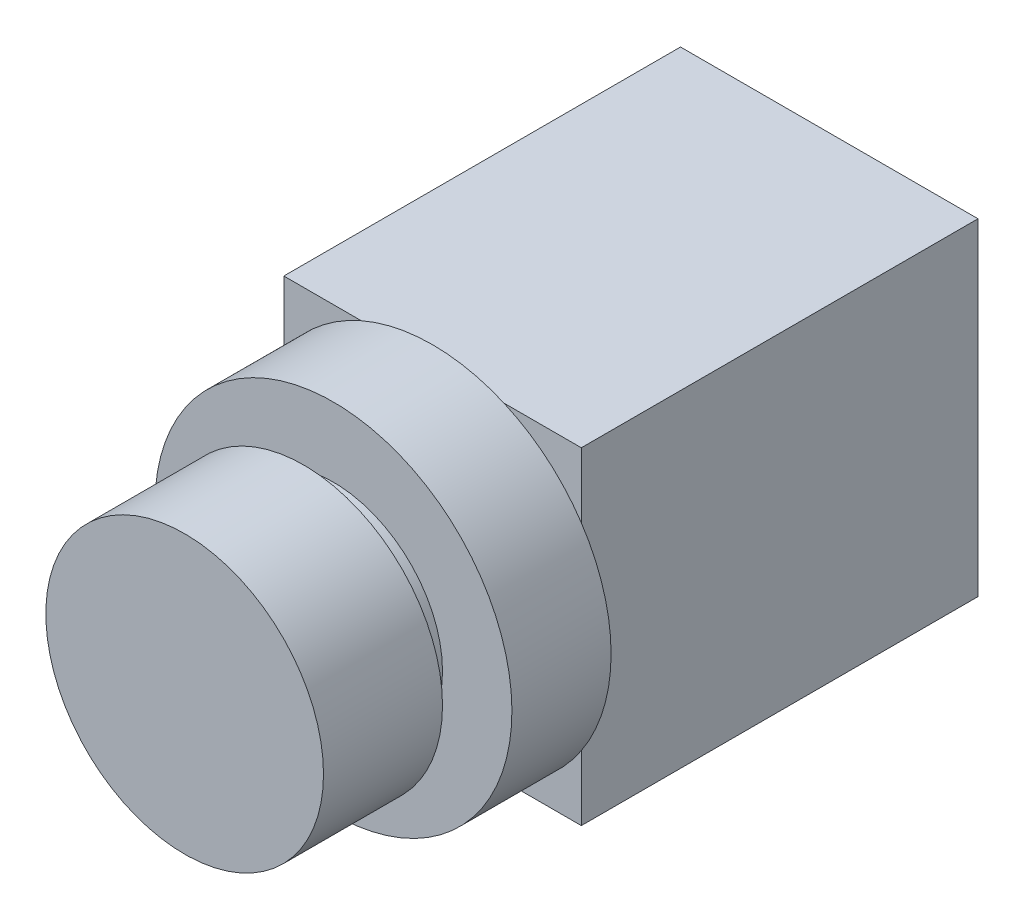
ISO-10303-21;
HEADER;
FILE_DESCRIPTION(('STEP AP214'),'2;1');
FILE_NAME('part.step','',(''),(''),'','','');
FILE_SCHEMA(('AUTOMOTIVE_DESIGN { 1 0 10303 214 1 1 1 1 }'));
ENDSEC;
DATA;
#1=APPLICATION_CONTEXT('core data for automotive mechanical design processes');
#2=APPLICATION_PROTOCOL_DEFINITION('international standard','automotive_design',2000,#1);
#3=PRODUCT_CONTEXT('',#1,'mechanical');
#4=PRODUCT('Part','Part','',(#3));
#5=PRODUCT_RELATED_PRODUCT_CATEGORY('part','',(#4));
#6=PRODUCT_DEFINITION_FORMATION('','',#4);
#7=PRODUCT_DEFINITION_CONTEXT('part definition',#1,'design');
#8=PRODUCT_DEFINITION('design','',#6,#7);
#9=PRODUCT_DEFINITION_SHAPE('','',#8);
#10=(LENGTH_UNIT() NAMED_UNIT(*) SI_UNIT(.MILLI.,.METRE.));
#11=(NAMED_UNIT(*) PLANE_ANGLE_UNIT() SI_UNIT($,.RADIAN.));
#12=(NAMED_UNIT(*) SI_UNIT($,.STERADIAN.) SOLID_ANGLE_UNIT());
#13=UNCERTAINTY_MEASURE_WITH_UNIT(LENGTH_MEASURE(1.E-05),#10,'distance_accuracy_value','');
#14=(GEOMETRIC_REPRESENTATION_CONTEXT(3) GLOBAL_UNCERTAINTY_ASSIGNED_CONTEXT((#13)) GLOBAL_UNIT_ASSIGNED_CONTEXT((#10,
#11,#12)) REPRESENTATION_CONTEXT('',''));
#15=CARTESIAN_POINT('',(0.,0.,0.));
#16=DIRECTION('',(0.,0.,1.));
#17=DIRECTION('',(1.,0.,0.));
#18=AXIS2_PLACEMENT_3D('',#15,#16,#17);
#19=CARTESIAN_POINT('',(0.,0.,-13.));
#20=DIRECTION('',(0.,0.,-1.));
#21=DIRECTION('',(-1.,0.,0.));
#22=AXIS2_PLACEMENT_3D('',#19,#20,#21);
#23=PLANE('',#22);
#24=CARTESIAN_POINT('',(0.,0.,-13.));
#25=DIRECTION('',(0.,0.,-1.));
#26=DIRECTION('',(-1.,0.,0.));
#27=AXIS2_PLACEMENT_3D('',#24,#25,#26);
#28=CIRCLE('',#27,18.);
#29=CARTESIAN_POINT('',(-7.19374728496907,16.5,-13.));
#30=VERTEX_POINT('',#29);
#31=CARTESIAN_POINT('',(7.19374728496907,16.5,-13.));
#32=VERTEX_POINT('',#31);
#33=EDGE_CURVE('E156',#30,#32,#28,.T.);
#34=ORIENTED_EDGE('',*,*,#33,.T.);
#35=DIRECTION('',(-1.,0.,0.));
#36=VECTOR('',#35,1.);
#37=CARTESIAN_POINT('',(15.,16.5,-13.));
#38=LINE('',#37,#36);
#39=EDGE_CURVE('E11',#32,#30,#38,.T.);
#40=ORIENTED_EDGE('',*,*,#39,.T.);
#41=EDGE_LOOP('',(#34,#40));
#42=FACE_BOUND('',#41,.T.);
#43=ADVANCED_FACE('F35',(#42),#23,.T.);
#44=CARTESIAN_POINT('',(-15.,-9.9498743710662,-13.));
#45=VERTEX_POINT('',#44);
#46=CARTESIAN_POINT('',(-15.,9.9498743710662,-13.));
#47=VERTEX_POINT('',#46);
#48=EDGE_CURVE('E157',#45,#47,#28,.T.);
#49=ORIENTED_EDGE('',*,*,#48,.T.);
#50=DIRECTION('',(0.,-1.,0.));
#51=VECTOR('',#50,1.);
#52=CARTESIAN_POINT('',(-15.,16.5,-13.));
#53=LINE('',#52,#51);
#54=EDGE_CURVE('E44',#47,#45,#53,.T.);
#55=ORIENTED_EDGE('',*,*,#54,.T.);
#56=EDGE_LOOP('',(#49,#55));
#57=FACE_BOUND('',#56,.T.);
#58=ADVANCED_FACE('F185',(#57),#23,.T.);
#59=DIRECTION('',(-1.,0.,0.));
#60=VECTOR('',#59,1.);
#61=CARTESIAN_POINT('',(15.,-16.5,-13.));
#62=LINE('',#61,#60);
#63=CARTESIAN_POINT('',(7.19374728496909,-16.5,-13.));
#64=VERTEX_POINT('',#63);
#65=CARTESIAN_POINT('',(-7.19374728496909,-16.5,-13.));
#66=VERTEX_POINT('',#65);
#67=EDGE_CURVE('E144',#64,#66,#62,.T.);
#68=ORIENTED_EDGE('',*,*,#67,.F.);
#69=EDGE_CURVE('E213',#64,#66,#28,.T.);
#70=ORIENTED_EDGE('',*,*,#69,.T.);
#71=EDGE_LOOP('',(#68,#70));
#72=FACE_BOUND('',#71,.T.);
#73=ADVANCED_FACE('F192',(#72),#23,.T.);
#74=CARTESIAN_POINT('',(0.,0.,12.));
#75=DIRECTION('',(0.,0.,-1.));
#76=DIRECTION('',(-1.,0.,0.));
#77=AXIS2_PLACEMENT_3D('',#74,#75,#76);
#78=CYLINDRICAL_SURFACE('',#77,14.);
#79=CARTESIAN_POINT('',(0.,0.,12.));
#80=DIRECTION('',(0.,0.,1.));
#81=DIRECTION('',(1.,0.,0.));
#82=AXIS2_PLACEMENT_3D('',#79,#80,#81);
#83=CIRCLE('',#82,14.);
#84=CARTESIAN_POINT('',(14.,0.,12.));
#85=VERTEX_POINT('',#84);
#86=EDGE_CURVE('E163',#85,#85,#83,.T.);
#87=ORIENTED_EDGE('',*,*,#86,.F.);
#88=EDGE_LOOP('',(#87));
#89=FACE_BOUND('',#88,.T.);
#90=CARTESIAN_POINT('',(0.,0.,0.));
#91=DIRECTION('',(0.,0.,1.));
#92=DIRECTION('',(1.,0.,0.));
#93=AXIS2_PLACEMENT_3D('',#90,#91,#92);
#94=CIRCLE('',#93,14.);
#95=CARTESIAN_POINT('',(14.,0.,0.));
#96=VERTEX_POINT('',#95);
#97=EDGE_CURVE('E162',#96,#96,#94,.T.);
#98=ORIENTED_EDGE('',*,*,#97,.T.);
#99=EDGE_LOOP('',(#98));
#100=FACE_BOUND('',#99,.T.);
#101=ADVANCED_FACE('F37',(#89,#100),#78,.T.);
#102=CARTESIAN_POINT('',(0.,0.,12.));
#103=DIRECTION('',(0.,0.,1.));
#104=DIRECTION('',(1.,0.,0.));
#105=AXIS2_PLACEMENT_3D('',#102,#103,#104);
#106=PLANE('',#105);
#107=ORIENTED_EDGE('',*,*,#86,.T.);
#108=EDGE_LOOP('',(#107));
#109=FACE_BOUND('',#108,.T.);
#110=ADVANCED_FACE('F172',(#109),#106,.T.);
#111=CARTESIAN_POINT('',(0.,0.,0.));
#112=DIRECTION('',(0.,0.,1.));
#113=DIRECTION('',(1.,0.,0.));
#114=AXIS2_PLACEMENT_3D('',#111,#112,#113);
#115=PLANE('',#114);
#116=CARTESIAN_POINT('',(0.,0.,0.));
#117=DIRECTION('',(0.,0.,1.));
#118=DIRECTION('',(1.,0.,0.));
#119=AXIS2_PLACEMENT_3D('',#116,#117,#118);
#120=CIRCLE('',#119,11.);
#121=CARTESIAN_POINT('',(11.,0.,0.));
#122=VERTEX_POINT('',#121);
#123=EDGE_CURVE('E39',#122,#122,#120,.F.);
#124=ORIENTED_EDGE('',*,*,#123,.F.);
#125=EDGE_LOOP('',(#124));
#126=FACE_BOUND('',#125,.T.);
#127=ORIENTED_EDGE('',*,*,#97,.F.);
#128=EDGE_LOOP('',(#127));
#129=FACE_BOUND('',#128,.T.);
#130=ADVANCED_FACE('F169',(#126,#129),#115,.F.);
#131=CARTESIAN_POINT('',(0.,0.,-3.));
#132=DIRECTION('',(0.,0.,1.));
#133=DIRECTION('',(1.,0.,0.));
#134=AXIS2_PLACEMENT_3D('',#131,#132,#133);
#135=CYLINDRICAL_SURFACE('',#134,11.);
#136=CARTESIAN_POINT('',(0.,0.,-3.));
#137=DIRECTION('',(0.,0.,-1.));
#138=DIRECTION('',(-1.,0.,0.));
#139=AXIS2_PLACEMENT_3D('',#136,#137,#138);
#140=CIRCLE('',#139,11.);
#141=CARTESIAN_POINT('',(-11.,0.,-3.));
#142=VERTEX_POINT('',#141);
#143=EDGE_CURVE('E155',#142,#142,#140,.T.);
#144=ORIENTED_EDGE('',*,*,#143,.F.);
#145=EDGE_LOOP('',(#144));
#146=FACE_BOUND('',#145,.T.);
#147=ORIENTED_EDGE('',*,*,#123,.T.);
#148=EDGE_LOOP('',(#147));
#149=FACE_BOUND('',#148,.T.);
#150=ADVANCED_FACE('F171',(#146,#149),#135,.T.);
#151=CARTESIAN_POINT('',(0.,0.,-13.));
#152=DIRECTION('',(0.,0.,1.));
#153=DIRECTION('',(1.,0.,0.));
#154=AXIS2_PLACEMENT_3D('',#151,#152,#153);
#155=CYLINDRICAL_SURFACE('',#154,18.);
#156=EDGE_CURVE('E152',#47,#30,#28,.T.);
#157=ORIENTED_EDGE('',*,*,#156,.F.);
#158=ORIENTED_EDGE('',*,*,#48,.F.);
#159=EDGE_CURVE('E59',#66,#45,#28,.T.);
#160=ORIENTED_EDGE('',*,*,#159,.F.);
#161=ORIENTED_EDGE('',*,*,#69,.F.);
#162=CARTESIAN_POINT('',(15.,-9.9498743710662,-13.));
#163=VERTEX_POINT('',#162);
#164=EDGE_CURVE('E221',#163,#64,#28,.T.);
#165=ORIENTED_EDGE('',*,*,#164,.F.);
#166=CARTESIAN_POINT('',(15.,9.9498743710662,-13.));
#167=VERTEX_POINT('',#166);
#168=EDGE_CURVE('E227',#167,#163,#28,.T.);
#169=ORIENTED_EDGE('',*,*,#168,.F.);
#170=EDGE_CURVE('E237',#32,#167,#28,.T.);
#171=ORIENTED_EDGE('',*,*,#170,.F.);
#172=ORIENTED_EDGE('',*,*,#33,.F.);
#173=EDGE_LOOP('',(#157,#158,#160,#161,#165,#169,#171,#172));
#174=FACE_BOUND('',#173,.T.);
#175=CARTESIAN_POINT('',(0.,0.,-3.));
#176=DIRECTION('',(0.,0.,-1.));
#177=DIRECTION('',(-1.,0.,0.));
#178=AXIS2_PLACEMENT_3D('',#175,#176,#177);
#179=CIRCLE('',#178,18.);
#180=CARTESIAN_POINT('',(-18.,0.,-3.));
#181=VERTEX_POINT('',#180);
#182=EDGE_CURVE('E147',#181,#181,#179,.T.);
#183=ORIENTED_EDGE('',*,*,#182,.T.);
#184=EDGE_LOOP('',(#183));
#185=FACE_BOUND('',#184,.T.);
#186=ADVANCED_FACE('F178',(#174,#185),#155,.T.);
#187=DIRECTION('',(0.,-1.,0.));
#188=VECTOR('',#187,1.);
#189=CARTESIAN_POINT('',(15.,16.5,-13.));
#190=LINE('',#189,#188);
#191=EDGE_CURVE('E134',#167,#163,#190,.T.);
#192=ORIENTED_EDGE('',*,*,#191,.F.);
#193=ORIENTED_EDGE('',*,*,#168,.T.);
#194=EDGE_LOOP('',(#192,#193));
#195=FACE_BOUND('',#194,.T.);
#196=ADVANCED_FACE('F188',(#195),#23,.T.);
#197=CARTESIAN_POINT('',(0.,0.,-3.));
#198=DIRECTION('',(0.,0.,-1.));
#199=DIRECTION('',(-1.,0.,0.));
#200=AXIS2_PLACEMENT_3D('',#197,#198,#199);
#201=PLANE('',#200);
#202=ORIENTED_EDGE('',*,*,#143,.T.);
#203=EDGE_LOOP('',(#202));
#204=FACE_BOUND('',#203,.T.);
#205=ORIENTED_EDGE('',*,*,#182,.F.);
#206=EDGE_LOOP('',(#205));
#207=FACE_BOUND('',#206,.T.);
#208=ADVANCED_FACE('F197',(#204,#207),#201,.F.);
#209=CARTESIAN_POINT('',(0.,0.,-13.));
#210=DIRECTION('',(0.,0.,1.));
#211=DIRECTION('',(1.,0.,0.));
#212=AXIS2_PLACEMENT_3D('',#209,#210,#211);
#213=PLANE('',#212);
#214=CARTESIAN_POINT('',(-15.,16.5,-13.));
#215=VERTEX_POINT('',#214);
#216=EDGE_CURVE('E110',#215,#47,#53,.T.);
#217=ORIENTED_EDGE('',*,*,#216,.T.);
#218=ORIENTED_EDGE('',*,*,#156,.T.);
#219=EDGE_CURVE('E47',#30,#215,#38,.T.);
#220=ORIENTED_EDGE('',*,*,#219,.T.);
#221=EDGE_LOOP('',(#217,#218,#220));
#222=FACE_BOUND('',#221,.T.);
#223=ADVANCED_FACE('F203',(#222),#213,.T.);
#224=CARTESIAN_POINT('',(15.,16.5,-13.));
#225=VERTEX_POINT('',#224);
#226=EDGE_CURVE('E46',#225,#32,#38,.T.);
#227=ORIENTED_EDGE('',*,*,#226,.T.);
#228=ORIENTED_EDGE('',*,*,#170,.T.);
#229=EDGE_CURVE('E129',#225,#167,#190,.T.);
#230=ORIENTED_EDGE('',*,*,#229,.F.);
#231=EDGE_LOOP('',(#227,#228,#230));
#232=FACE_BOUND('',#231,.T.);
#233=ADVANCED_FACE('F239',(#232),#213,.T.);
#234=CARTESIAN_POINT('',(15.,-16.5,-13.));
#235=VERTEX_POINT('',#234);
#236=EDGE_CURVE('E132',#163,#235,#190,.T.);
#237=ORIENTED_EDGE('',*,*,#236,.F.);
#238=ORIENTED_EDGE('',*,*,#164,.T.);
#239=EDGE_CURVE('E142',#235,#64,#62,.T.);
#240=ORIENTED_EDGE('',*,*,#239,.F.);
#241=EDGE_LOOP('',(#237,#238,#240));
#242=FACE_BOUND('',#241,.T.);
#243=ADVANCED_FACE('F225',(#242),#213,.T.);
#244=CARTESIAN_POINT('',(15.,16.5,-53.));
#245=DIRECTION('',(0.,1.,0.));
#246=DIRECTION('',(0.,0.,1.));
#247=AXIS2_PLACEMENT_3D('',#244,#245,#246);
#248=PLANE('',#247);
#249=ORIENTED_EDGE('',*,*,#226,.F.);
#250=DIRECTION('',(0.,0.,1.));
#251=VECTOR('',#250,1.);
#252=CARTESIAN_POINT('',(15.,16.5,-53.));
#253=LINE('',#252,#251);
#254=CARTESIAN_POINT('',(15.,16.5,-53.));
#255=VERTEX_POINT('',#254);
#256=EDGE_CURVE('E127',#255,#225,#253,.T.);
#257=ORIENTED_EDGE('',*,*,#256,.F.);
#258=DIRECTION('',(-1.,0.,0.));
#259=VECTOR('',#258,1.);
#260=CARTESIAN_POINT('',(15.,16.5,-53.));
#261=LINE('',#260,#259);
#262=CARTESIAN_POINT('',(-15.,16.5,-53.));
#263=VERTEX_POINT('',#262);
#264=EDGE_CURVE('E120',#255,#263,#261,.T.);
#265=ORIENTED_EDGE('',*,*,#264,.T.);
#266=DIRECTION('',(0.,0.,1.));
#267=VECTOR('',#266,1.);
#268=CARTESIAN_POINT('',(-15.,16.5,-53.));
#269=LINE('',#268,#267);
#270=EDGE_CURVE('E104',#263,#215,#269,.T.);
#271=ORIENTED_EDGE('',*,*,#270,.T.);
#272=ORIENTED_EDGE('',*,*,#219,.F.);
#273=ORIENTED_EDGE('',*,*,#39,.F.);
#274=EDGE_LOOP('',(#249,#257,#265,#271,#272,#273));
#275=FACE_BOUND('',#274,.T.);
#276=ADVANCED_FACE('F126',(#275),#248,.T.);
#277=CARTESIAN_POINT('',(15.,16.5,-53.));
#278=DIRECTION('',(-1.,0.,0.));
#279=DIRECTION('',(0.,-1.,0.));
#280=AXIS2_PLACEMENT_3D('',#277,#278,#279);
#281=PLANE('',#280);
#282=ORIENTED_EDGE('',*,*,#229,.T.);
#283=ORIENTED_EDGE('',*,*,#191,.T.);
#284=ORIENTED_EDGE('',*,*,#236,.T.);
#285=DIRECTION('',(0.,0.,1.));
#286=VECTOR('',#285,1.);
#287=CARTESIAN_POINT('',(15.,-16.5,-53.));
#288=LINE('',#287,#286);
#289=CARTESIAN_POINT('',(15.,-16.5,-53.));
#290=VERTEX_POINT('',#289);
#291=EDGE_CURVE('E148',#290,#235,#288,.T.);
#292=ORIENTED_EDGE('',*,*,#291,.F.);
#293=DIRECTION('',(0.,-1.,0.));
#294=VECTOR('',#293,1.);
#295=CARTESIAN_POINT('',(15.,16.5,-53.));
#296=LINE('',#295,#294);
#297=EDGE_CURVE('E115',#255,#290,#296,.T.);
#298=ORIENTED_EDGE('',*,*,#297,.F.);
#299=ORIENTED_EDGE('',*,*,#256,.T.);
#300=EDGE_LOOP('',(#282,#283,#284,#292,#298,#299));
#301=FACE_BOUND('',#300,.T.);
#302=ADVANCED_FACE('F231',(#301),#281,.F.);
#303=CARTESIAN_POINT('',(15.,-16.5,-53.));
#304=DIRECTION('',(0.,1.,0.));
#305=DIRECTION('',(0.,0.,1.));
#306=AXIS2_PLACEMENT_3D('',#303,#304,#305);
#307=PLANE('',#306);
#308=ORIENTED_EDGE('',*,*,#239,.T.);
#309=ORIENTED_EDGE('',*,*,#67,.T.);
#310=CARTESIAN_POINT('',(-15.,-16.5,-13.));
#311=VERTEX_POINT('',#310);
#312=EDGE_CURVE('E141',#66,#311,#62,.T.);
#313=ORIENTED_EDGE('',*,*,#312,.T.);
#314=DIRECTION('',(0.,0.,1.));
#315=VECTOR('',#314,1.);
#316=CARTESIAN_POINT('',(-15.,-16.5,-53.));
#317=LINE('',#316,#315);
#318=CARTESIAN_POINT('',(-15.,-16.5,-53.));
#319=VERTEX_POINT('',#318);
#320=EDGE_CURVE('E114',#319,#311,#317,.T.);
#321=ORIENTED_EDGE('',*,*,#320,.F.);
#322=DIRECTION('',(-1.,0.,0.));
#323=VECTOR('',#322,1.);
#324=CARTESIAN_POINT('',(15.,-16.5,-53.));
#325=LINE('',#324,#323);
#326=EDGE_CURVE('E122',#290,#319,#325,.T.);
#327=ORIENTED_EDGE('',*,*,#326,.F.);
#328=ORIENTED_EDGE('',*,*,#291,.T.);
#329=EDGE_LOOP('',(#308,#309,#313,#321,#327,#328));
#330=FACE_BOUND('',#329,.T.);
#331=ADVANCED_FACE('F228',(#330),#307,.F.);
#332=CARTESIAN_POINT('',(-15.,16.5,-53.));
#333=DIRECTION('',(-1.,0.,0.));
#334=DIRECTION('',(0.,-1.,0.));
#335=AXIS2_PLACEMENT_3D('',#332,#333,#334);
#336=PLANE('',#335);
#337=ORIENTED_EDGE('',*,*,#216,.F.);
#338=ORIENTED_EDGE('',*,*,#270,.F.);
#339=DIRECTION('',(0.,-1.,0.));
#340=VECTOR('',#339,1.);
#341=CARTESIAN_POINT('',(-15.,16.5,-53.));
#342=LINE('',#341,#340);
#343=EDGE_CURVE('E108',#263,#319,#342,.T.);
#344=ORIENTED_EDGE('',*,*,#343,.T.);
#345=ORIENTED_EDGE('',*,*,#320,.T.);
#346=EDGE_CURVE('E139',#45,#311,#53,.T.);
#347=ORIENTED_EDGE('',*,*,#346,.F.);
#348=ORIENTED_EDGE('',*,*,#54,.F.);
#349=EDGE_LOOP('',(#337,#338,#344,#345,#347,#348));
#350=FACE_BOUND('',#349,.T.);
#351=ADVANCED_FACE('F106',(#350),#336,.T.);
#352=CARTESIAN_POINT('',(0.,0.,-53.));
#353=DIRECTION('',(0.,0.,1.));
#354=DIRECTION('',(1.,0.,0.));
#355=AXIS2_PLACEMENT_3D('',#352,#353,#354);
#356=PLANE('',#355);
#357=ORIENTED_EDGE('',*,*,#264,.F.);
#358=ORIENTED_EDGE('',*,*,#297,.T.);
#359=ORIENTED_EDGE('',*,*,#326,.T.);
#360=ORIENTED_EDGE('',*,*,#343,.F.);
#361=EDGE_LOOP('',(#357,#358,#359,#360));
#362=FACE_BOUND('',#361,.T.);
#363=ADVANCED_FACE('F119',(#362),#356,.F.);
#364=ORIENTED_EDGE('',*,*,#312,.F.);
#365=ORIENTED_EDGE('',*,*,#159,.T.);
#366=ORIENTED_EDGE('',*,*,#346,.T.);
#367=EDGE_LOOP('',(#364,#365,#366));
#368=FACE_BOUND('',#367,.T.);
#369=ADVANCED_FACE('F245',(#368),#213,.T.);
#370=CLOSED_SHELL('',(#43,#58,#73,#101,#110,#130,#150,#186,#196,#208,#223,#233,#243,#276,#302,
#331,#351,#363,#369));
#371=MANIFOLD_SOLID_BREP('B2',#370);
#372=ADVANCED_BREP_SHAPE_REPRESENTATION('',(#18,#371),#14);
#373=SHAPE_DEFINITION_REPRESENTATION(#9,#372);
ENDSEC;
END-ISO-10303-21;
